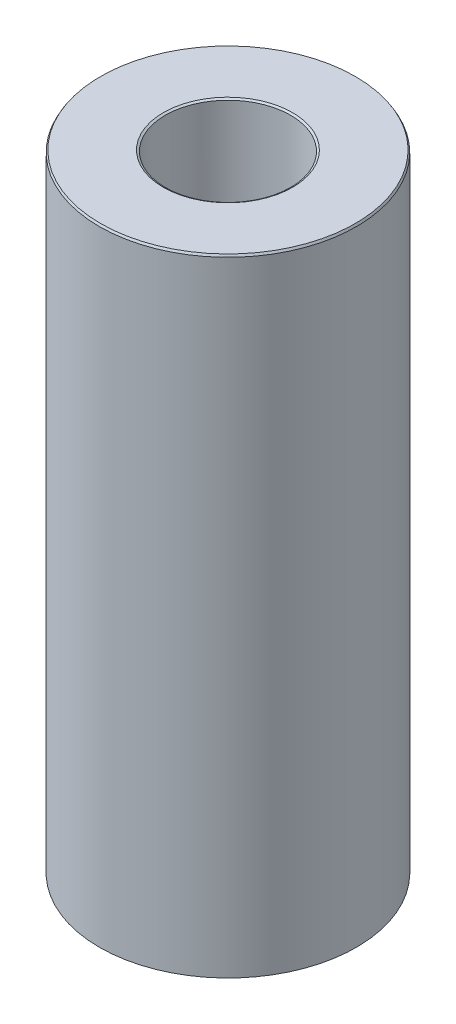
ISO-10303-21;
HEADER;
FILE_DESCRIPTION(('STEP AP214'),'2;1');
FILE_NAME('part.step','',(''),(''),'','','');
FILE_SCHEMA(('AUTOMOTIVE_DESIGN { 1 0 10303 214 1 1 1 1 }'));
ENDSEC;
DATA;
#1=APPLICATION_CONTEXT('core data for automotive mechanical design processes');
#2=APPLICATION_PROTOCOL_DEFINITION('international standard','automotive_design',2000,#1);
#3=PRODUCT_CONTEXT('',#1,'mechanical');
#4=PRODUCT('Part','Part','',(#3));
#5=PRODUCT_RELATED_PRODUCT_CATEGORY('part','',(#4));
#6=PRODUCT_DEFINITION_FORMATION('','',#4);
#7=PRODUCT_DEFINITION_CONTEXT('part definition',#1,'design');
#8=PRODUCT_DEFINITION('design','',#6,#7);
#9=PRODUCT_DEFINITION_SHAPE('','',#8);
#10=(LENGTH_UNIT() NAMED_UNIT(*) SI_UNIT(.MILLI.,.METRE.));
#11=(NAMED_UNIT(*) PLANE_ANGLE_UNIT() SI_UNIT($,.RADIAN.));
#12=(NAMED_UNIT(*) SI_UNIT($,.STERADIAN.) SOLID_ANGLE_UNIT());
#13=UNCERTAINTY_MEASURE_WITH_UNIT(LENGTH_MEASURE(1.E-05),#10,'distance_accuracy_value','');
#14=(GEOMETRIC_REPRESENTATION_CONTEXT(3) GLOBAL_UNCERTAINTY_ASSIGNED_CONTEXT((#13)) GLOBAL_UNIT_ASSIGNED_CONTEXT((#10,
#11,#12)) REPRESENTATION_CONTEXT('',''));
#15=CARTESIAN_POINT('',(0.,0.,0.));
#16=DIRECTION('',(0.,0.,1.));
#17=DIRECTION('',(1.,0.,0.));
#18=AXIS2_PLACEMENT_3D('',#15,#16,#17);
#19=CARTESIAN_POINT('',(0.,244.012405665669,0.));
#20=DIRECTION('',(0.,-1.,0.));
#21=DIRECTION('',(0.,0.,-1.));
#22=AXIS2_PLACEMENT_3D('',#19,#20,#21);
#23=CYLINDRICAL_SURFACE('',#22,50.);
#24=CARTESIAN_POINT('',(0.,0.460823689385215,0.));
#25=DIRECTION('',(0.,1.,0.));
#26=DIRECTION('',(0.,0.,1.));
#27=AXIS2_PLACEMENT_3D('',#24,#25,#26);
#28=CIRCLE('',#27,50.);
#29=CARTESIAN_POINT('',(0.,0.460823689385215,50.));
#30=VERTEX_POINT('',#29);
#31=EDGE_CURVE('E10',#30,#30,#28,.T.);
#32=ORIENTED_EDGE('',*,*,#31,.T.);
#33=EDGE_LOOP('',(#32));
#34=FACE_BOUND('',#33,.T.);
#35=CARTESIAN_POINT('',(0.,243.214235622322,0.));
#36=DIRECTION('',(0.,1.,0.));
#37=DIRECTION('',(0.,0.,1.));
#38=AXIS2_PLACEMENT_3D('',#35,#36,#37);
#39=CIRCLE('',#38,50.);
#40=CARTESIAN_POINT('',(0.,243.214235622322,50.));
#41=VERTEX_POINT('',#40);
#42=EDGE_CURVE('E50',#41,#41,#39,.F.);
#43=ORIENTED_EDGE('',*,*,#42,.T.);
#44=EDGE_LOOP('',(#43));
#45=FACE_BOUND('',#44,.T.);
#46=ADVANCED_FACE('F39',(#34,#45),#23,.T.);
#47=CARTESIAN_POINT('',(0.,244.012405665669,0.));
#48=DIRECTION('',(0.,1.,0.));
#49=DIRECTION('',(0.,0.,1.));
#50=AXIS2_PLACEMENT_3D('',#47,#48,#49);
#51=PLANE('',#50);
#52=CARTESIAN_POINT('',(0.,244.012405665669,0.));
#53=DIRECTION('',(0.,1.,0.));
#54=DIRECTION('',(0.,0.,1.));
#55=AXIS2_PLACEMENT_3D('',#52,#53,#54);
#56=CIRCLE('',#55,25.1570819699607);
#57=CARTESIAN_POINT('',(0.,244.012405665669,25.1570819699607));
#58=VERTEX_POINT('',#57);
#59=EDGE_CURVE('E58',#58,#58,#56,.F.);
#60=ORIENTED_EDGE('',*,*,#59,.T.);
#61=EDGE_LOOP('',(#60));
#62=FACE_BOUND('',#61,.T.);
#63=CARTESIAN_POINT('',(0.,244.012405665669,0.));
#64=DIRECTION('',(0.,1.,0.));
#65=DIRECTION('',(0.,0.,1.));
#66=AXIS2_PLACEMENT_3D('',#63,#64,#65);
#67=CIRCLE('',#66,49.5391763106147);
#68=CARTESIAN_POINT('',(0.,244.012405665669,49.5391763106147));
#69=VERTEX_POINT('',#68);
#70=EDGE_CURVE('E61',#69,#69,#67,.T.);
#71=ORIENTED_EDGE('',*,*,#70,.T.);
#72=EDGE_LOOP('',(#71));
#73=FACE_BOUND('',#72,.T.);
#74=ADVANCED_FACE('F88',(#62,#73),#51,.T.);
#75=CARTESIAN_POINT('',(0.,0.,0.));
#76=DIRECTION('',(0.,1.,0.));
#77=DIRECTION('',(0.,0.,1.));
#78=AXIS2_PLACEMENT_3D('',#75,#76,#77);
#79=PLANE('',#78);
#80=CARTESIAN_POINT('',(0.,0.,0.));
#81=DIRECTION('',(0.,1.,0.));
#82=DIRECTION('',(0.,0.,1.));
#83=AXIS2_PLACEMENT_3D('',#80,#81,#82);
#84=CIRCLE('',#83,24.8197356159993);
#85=CARTESIAN_POINT('',(0.,0.,-24.8197356159993));
#86=VERTEX_POINT('',#85);
#87=EDGE_CURVE('E51',#86,#86,#84,.T.);
#88=ORIENTED_EDGE('',*,*,#87,.T.);
#89=EDGE_LOOP('',(#88));
#90=FACE_BOUND('',#89,.T.);
#91=CARTESIAN_POINT('',(0.,0.,0.));
#92=DIRECTION('',(0.,1.,0.));
#93=DIRECTION('',(0.,0.,1.));
#94=AXIS2_PLACEMENT_3D('',#91,#92,#93);
#95=CIRCLE('',#94,49.2018299566534);
#96=CARTESIAN_POINT('',(0.,0.,49.2018299566534));
#97=VERTEX_POINT('',#96);
#98=EDGE_CURVE('E54',#97,#97,#95,.F.);
#99=ORIENTED_EDGE('',*,*,#98,.T.);
#100=EDGE_LOOP('',(#99));
#101=FACE_BOUND('',#100,.T.);
#102=ADVANCED_FACE('F83',(#90,#101),#79,.F.);
#103=CARTESIAN_POINT('',(0.,244.012405665669,0.));
#104=DIRECTION('',(0.,-1.,0.));
#105=DIRECTION('',(0.,0.,-1.));
#106=AXIS2_PLACEMENT_3D('',#103,#104,#105);
#107=CYLINDRICAL_SURFACE('',#106,24.3589119266141);
#108=CARTESIAN_POINT('',(0.,243.551581976283,0.));
#109=DIRECTION('',(0.,1.,0.));
#110=DIRECTION('',(0.,0.,1.));
#111=AXIS2_PLACEMENT_3D('',#108,#109,#110);
#112=CIRCLE('',#111,24.3589119266141);
#113=CARTESIAN_POINT('',(0.,243.551581976283,24.3589119266141));
#114=VERTEX_POINT('',#113);
#115=EDGE_CURVE('E67',#114,#114,#112,.T.);
#116=ORIENTED_EDGE('',*,*,#115,.T.);
#117=EDGE_LOOP('',(#116));
#118=FACE_BOUND('',#117,.T.);
#119=CARTESIAN_POINT('',(0.,0.798170043346591,0.));
#120=DIRECTION('',(0.,1.,0.));
#121=DIRECTION('',(0.,0.,1.));
#122=AXIS2_PLACEMENT_3D('',#119,#120,#121);
#123=CIRCLE('',#122,24.3589119266141);
#124=CARTESIAN_POINT('',(0.,0.798170043346591,-24.3589119266141));
#125=VERTEX_POINT('',#124);
#126=EDGE_CURVE('E69',#125,#125,#123,.F.);
#127=ORIENTED_EDGE('',*,*,#126,.T.);
#128=EDGE_LOOP('',(#127));
#129=FACE_BOUND('',#128,.T.);
#130=ADVANCED_FACE('F71',(#118,#129),#107,.F.);
#131=CARTESIAN_POINT('',(0.,243.551581976283,0.));
#132=DIRECTION('',(0.,1.,0.));
#133=DIRECTION('',(0.,0.,1.));
#134=AXIS2_PLACEMENT_3D('',#131,#132,#133);
#135=CONICAL_SURFACE('',#134,24.3589119266141,1.04719755119659);
#136=ORIENTED_EDGE('',*,*,#59,.F.);
#137=EDGE_LOOP('',(#136));
#138=FACE_BOUND('',#137,.T.);
#139=ORIENTED_EDGE('',*,*,#115,.F.);
#140=EDGE_LOOP('',(#139));
#141=FACE_BOUND('',#140,.T.);
#142=ADVANCED_FACE('F77',(#138,#141),#135,.F.);
#143=CARTESIAN_POINT('',(0.,0.,0.));
#144=DIRECTION('',(0.,-1.,0.));
#145=DIRECTION('',(0.,0.,-1.));
#146=AXIS2_PLACEMENT_3D('',#143,#144,#145);
#147=CONICAL_SURFACE('',#146,24.8197356159993,0.523598775598286);
#148=CARTESIAN_POINT('',(0.,0.798170043346591,-24.3589119266141));
#149=CARTESIAN_POINT('',(0.,0.789855772061731,-24.3637121733785));
#150=CARTESIAN_POINT('',(0.,0.781541500776871,-24.368512420143));
#151=CARTESIAN_POINT('',(0.,0.76491295820715,-24.3781129136718));
#152=CARTESIAN_POINT('',(0.,0.756598686922289,-24.3829131604362));
#153=CARTESIAN_POINT('',(0.,0.739970144352568,-24.3925136539651));
#154=CARTESIAN_POINT('',(0.,0.731655873067708,-24.3973139007295));
#155=CARTESIAN_POINT('',(0.,0.715027330497988,-24.4069143942584));
#156=CARTESIAN_POINT('',(0.,0.706713059213128,-24.4117146410228));
#157=CARTESIAN_POINT('',(0.,0.690084516643407,-24.4213151345517));
#158=CARTESIAN_POINT('',(0.,0.681770245358546,-24.4261153813161));
#159=CARTESIAN_POINT('',(0.,0.665141702788825,-24.435715874845));
#160=CARTESIAN_POINT('',(0.,0.656827431503965,-24.4405161216094));
#161=CARTESIAN_POINT('',(0.,0.640198888934245,-24.4501166151383));
#162=CARTESIAN_POINT('',(0.,0.631884617649384,-24.4549168619027));
#163=CARTESIAN_POINT('',(0.,0.615256075079664,-24.4645173554315));
#164=CARTESIAN_POINT('',(0.,0.606941803794804,-24.469317602196));
#165=CARTESIAN_POINT('',(0.,0.590313261225083,-24.4789180957248));
#166=CARTESIAN_POINT('',(0.,0.581998989940222,-24.4837183424893));
#167=CARTESIAN_POINT('',(0.,0.565370447370502,-24.4933188360181));
#168=CARTESIAN_POINT('',(0.,0.557056176085641,-24.4981190827826));
#169=CARTESIAN_POINT('',(0.,0.540427633515921,-24.5077195763114));
#170=CARTESIAN_POINT('',(0.,0.532113362231061,-24.5125198230758));
#171=CARTESIAN_POINT('',(0.,0.51548481966134,-24.5221203166047));
#172=CARTESIAN_POINT('',(0.,0.507170548376479,-24.5269205633691));
#173=CARTESIAN_POINT('',(0.,0.490542005806759,-24.536521056898));
#174=CARTESIAN_POINT('',(0.,0.482227734521898,-24.5413213036624));
#175=CARTESIAN_POINT('',(0.,0.465599191952178,-24.5509217971913));
#176=CARTESIAN_POINT('',(0.,0.457284920667318,-24.5557220439557));
#177=CARTESIAN_POINT('',(0.,0.440656378097597,-24.5653225374846));
#178=CARTESIAN_POINT('',(0.,0.432342106812737,-24.570122784249));
#179=CARTESIAN_POINT('',(0.,0.415713564243016,-24.5797232777779));
#180=CARTESIAN_POINT('',(0.,0.407399292958156,-24.5845235245423));
#181=CARTESIAN_POINT('',(0.,0.390770750388435,-24.5941240180711));
#182=CARTESIAN_POINT('',(0.,0.382456479103575,-24.5989242648356));
#183=CARTESIAN_POINT('',(0.,0.365827936533854,-24.6085247583644));
#184=CARTESIAN_POINT('',(0.,0.357513665248994,-24.6133250051289));
#185=CARTESIAN_POINT('',(0.,0.340885122679273,-24.6229254986577));
#186=CARTESIAN_POINT('',(0.,0.332570851394413,-24.6277257454221));
#187=CARTESIAN_POINT('',(0.,0.315942308824692,-24.637326238951));
#188=CARTESIAN_POINT('',(0.,0.307628037539832,-24.6421264857154));
#189=CARTESIAN_POINT('',(0.,0.290999494970111,-24.6517269792443));
#190=CARTESIAN_POINT('',(0.,0.282685223685251,-24.6565272260087));
#191=CARTESIAN_POINT('',(0.,0.26605668111553,-24.6661277195376));
#192=CARTESIAN_POINT('',(0.,0.25774240983067,-24.670927966302));
#193=CARTESIAN_POINT('',(0.,0.241113867260949,-24.6805284598309));
#194=CARTESIAN_POINT('',(0.,0.232799595976089,-24.6853287065953));
#195=CARTESIAN_POINT('',(0.,0.216171053406369,-24.6949292001242));
#196=CARTESIAN_POINT('',(0.,0.207856782121508,-24.6997294468886));
#197=CARTESIAN_POINT('',(0.,0.191228239551787,-24.7093299404175));
#198=CARTESIAN_POINT('',(0.,0.182913968266927,-24.7141301871819));
#199=CARTESIAN_POINT('',(0.,0.166285425697207,-24.7237306807107));
#200=CARTESIAN_POINT('',(0.,0.157971154412346,-24.7285309274752));
#201=CARTESIAN_POINT('',(0.,0.141342611842626,-24.738131421004));
#202=CARTESIAN_POINT('',(0.,0.133028340557765,-24.7429316677685));
#203=CARTESIAN_POINT('',(0.,0.116399797988045,-24.7525321612973));
#204=CARTESIAN_POINT('',(0.,0.108085526703184,-24.7573324080617));
#205=CARTESIAN_POINT('',(0.,0.0914569841334632,-24.7669329015906));
#206=CARTESIAN_POINT('',(0.,0.0831427128486031,-24.771733148355));
#207=CARTESIAN_POINT('',(0.,0.0665141702788827,-24.7813336418839));
#208=CARTESIAN_POINT('',(0.,0.0581998989940225,-24.7861338886483));
#209=CARTESIAN_POINT('',(0.,0.0415713564243018,-24.7957343821772));
#210=CARTESIAN_POINT('',(0.,0.0332570851394413,-24.8005346289416));
#211=CARTESIAN_POINT('',(0.,0.0166285425697202,-24.8101351224705));
#212=CARTESIAN_POINT('',(0.,0.00831427128485961,-24.8149353692349));
#213=CARTESIAN_POINT('',(0.,0.,-24.8197356159993));
#214=B_SPLINE_CURVE_WITH_KNOTS('',3,(#148,#149,#150,#151,#152,#153,#154,#155,#156,#157,#158,
#159,#160,#161,#162,#163,#164,#165,#166,#167,#168,#169,#170,#171,#172,#173,#174,#175,#176,#177,
#178,#179,#180,#181,#182,#183,#184,#185,#186,#187,#188,#189,#190,#191,#192,#193,#194,#195,#196,
#197,#198,#199,#200,#201,#202,#203,#204,#205,#206,#207,#208,#209,#210,#211,#212,#213),
.UNSPECIFIED.,.F.,.F.,(4,2,2,2,2,2,2,2,2,2,2,2,2,2,2,2,2,2,2,2,2,2,2,2,2,2,2,2,2,2,2,2,4),(0.,
0.0288014805865784,0.0576029611731551,0.0864044417597335,0.115205922346312,0.144007402932889,
0.172808883519467,0.201610364106045,0.230411844692624,0.259213325279201,0.288014805865779,
0.316816286452357,0.345617767038934,0.374419247625512,0.403220728212091,0.432022208798667,
0.460823689385246,0.489625169971824,0.518426650558401,0.547228131144979,0.576029611731558,
0.604831092318134,0.633632572904713,0.662434053491291,0.691235534077868,0.720037014664446,
0.748838495251025,0.777639975837603,0.80644145642418,0.835242937010758,0.864044417597337,
0.892845898183913,0.921647378770492),.UNSPECIFIED.);
#215=EDGE_CURVE('BSEAM73',#125,#86,#214,.T.);
#216=ORIENTED_EDGE('',*,*,#126,.F.);
#217=ORIENTED_EDGE('',*,*,#87,.F.);
#218=ORIENTED_EDGE('',*,*,#215,.T.);
#219=ORIENTED_EDGE('',*,*,#215,.F.);
#220=EDGE_LOOP('',(#216,#218,#217,#219));
#221=FACE_BOUND('',#220,.T.);
#222=ADVANCED_FACE('F73',(#221),#147,.F.);
#223=CARTESIAN_POINT('',(0.,0.460823689385215,0.));
#224=DIRECTION('',(0.,1.,0.));
#225=DIRECTION('',(0.,0.,1.));
#226=AXIS2_PLACEMENT_3D('',#223,#224,#225);
#227=CONICAL_SURFACE('',#226,50.,1.04719755119662);
#228=ORIENTED_EDGE('',*,*,#98,.F.);
#229=EDGE_LOOP('',(#228));
#230=FACE_BOUND('',#229,.T.);
#231=ORIENTED_EDGE('',*,*,#31,.F.);
#232=EDGE_LOOP('',(#231));
#233=FACE_BOUND('',#232,.T.);
#234=ADVANCED_FACE('F76',(#230,#233),#227,.T.);
#235=CARTESIAN_POINT('',(0.,244.012405665669,0.));
#236=DIRECTION('',(0.,-1.,0.));
#237=DIRECTION('',(0.,0.,-1.));
#238=AXIS2_PLACEMENT_3D('',#235,#236,#237);
#239=CONICAL_SURFACE('',#238,49.5391763106147,0.523598775598267);
#240=ORIENTED_EDGE('',*,*,#42,.F.);
#241=EDGE_LOOP('',(#240));
#242=FACE_BOUND('',#241,.T.);
#243=ORIENTED_EDGE('',*,*,#70,.F.);
#244=EDGE_LOOP('',(#243));
#245=FACE_BOUND('',#244,.T.);
#246=ADVANCED_FACE('F45',(#242,#245),#239,.T.);
#247=CLOSED_SHELL('',(#46,#74,#102,#130,#142,#222,#234,#246));
#248=MANIFOLD_SOLID_BREP('B2',#247);
#249=ADVANCED_BREP_SHAPE_REPRESENTATION('',(#18,#248),#14);
#250=SHAPE_DEFINITION_REPRESENTATION(#9,#249);
ENDSEC;
END-ISO-10303-21;
